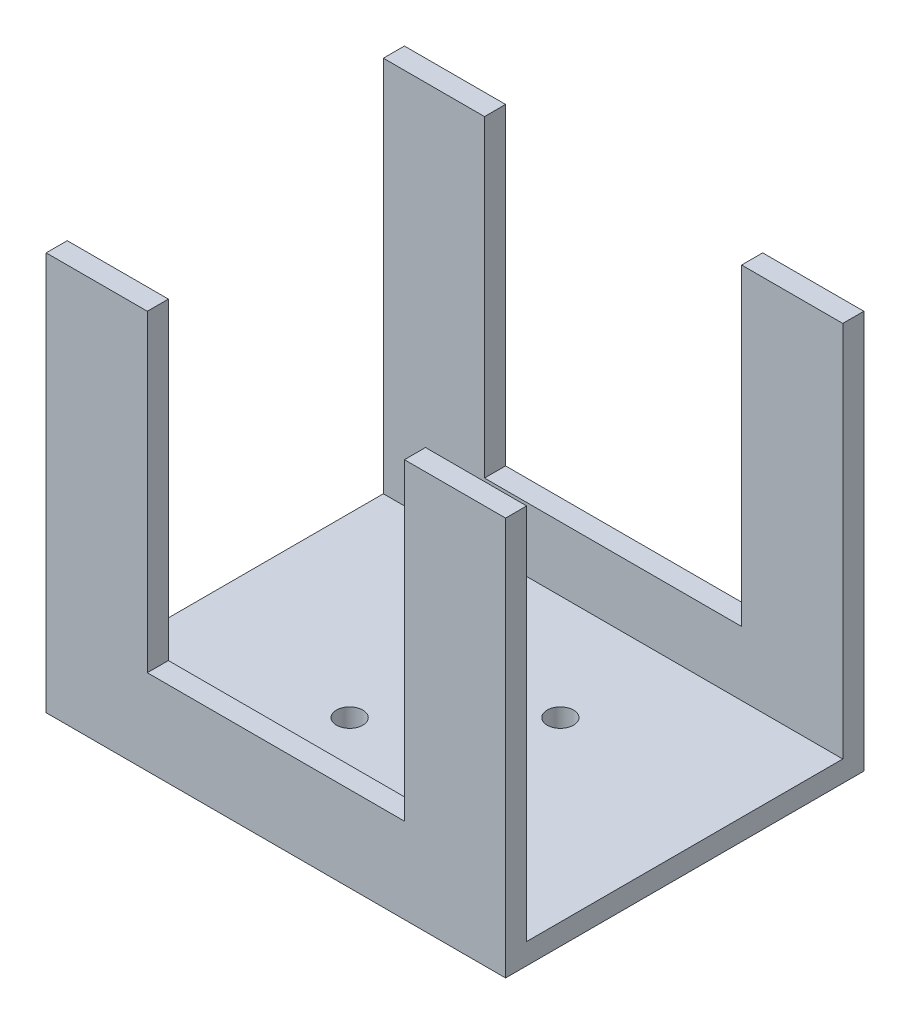
ISO-10303-21;
HEADER;
FILE_DESCRIPTION(('STEP AP214'),'2;1');
FILE_NAME('part.step','',(''),(''),'','','');
FILE_SCHEMA(('AUTOMOTIVE_DESIGN { 1 0 10303 214 1 1 1 1 }'));
ENDSEC;
DATA;
#1=APPLICATION_CONTEXT('core data for automotive mechanical design processes');
#2=APPLICATION_PROTOCOL_DEFINITION('international standard','automotive_design',2000,#1);
#3=PRODUCT_CONTEXT('',#1,'mechanical');
#4=PRODUCT('Part','Part','',(#3));
#5=PRODUCT_RELATED_PRODUCT_CATEGORY('part','',(#4));
#6=PRODUCT_DEFINITION_FORMATION('','',#4);
#7=PRODUCT_DEFINITION_CONTEXT('part definition',#1,'design');
#8=PRODUCT_DEFINITION('design','',#6,#7);
#9=PRODUCT_DEFINITION_SHAPE('','',#8);
#10=(LENGTH_UNIT() NAMED_UNIT(*) SI_UNIT(.MILLI.,.METRE.));
#11=(NAMED_UNIT(*) PLANE_ANGLE_UNIT() SI_UNIT($,.RADIAN.));
#12=(NAMED_UNIT(*) SI_UNIT($,.STERADIAN.) SOLID_ANGLE_UNIT());
#13=UNCERTAINTY_MEASURE_WITH_UNIT(LENGTH_MEASURE(1.E-05),#10,'distance_accuracy_value','');
#14=(GEOMETRIC_REPRESENTATION_CONTEXT(3) GLOBAL_UNCERTAINTY_ASSIGNED_CONTEXT((#13)) GLOBAL_UNIT_ASSIGNED_CONTEXT((#10,
#11,#12)) REPRESENTATION_CONTEXT('',''));
#15=CARTESIAN_POINT('',(0.,0.,0.));
#16=DIRECTION('',(0.,0.,1.));
#17=DIRECTION('',(1.,0.,0.));
#18=AXIS2_PLACEMENT_3D('',#15,#16,#17);
#19=CARTESIAN_POINT('',(-21.8,2.,-17.));
#20=DIRECTION('',(0.,0.,1.));
#21=DIRECTION('',(1.,0.,0.));
#22=AXIS2_PLACEMENT_3D('',#19,#20,#21);
#23=PLANE('',#22);
#24=DIRECTION('',(0.,-1.,0.));
#25=VECTOR('',#24,1.);
#26=CARTESIAN_POINT('',(12.2,2.,-17.));
#27=LINE('',#26,#25);
#28=CARTESIAN_POINT('',(12.2,37.8,-17.));
#29=VERTEX_POINT('',#28);
#30=CARTESIAN_POINT('',(12.2,8.09,-17.));
#31=VERTEX_POINT('',#30);
#32=EDGE_CURVE('E288',#29,#31,#27,.T.);
#33=ORIENTED_EDGE('',*,*,#32,.F.);
#34=DIRECTION('',(-1.,0.,0.));
#35=VECTOR('',#34,1.);
#36=CARTESIAN_POINT('',(-21.8,37.8,-17.));
#37=LINE('',#36,#35);
#38=CARTESIAN_POINT('',(21.8,37.8,-17.));
#39=VERTEX_POINT('',#38);
#40=EDGE_CURVE('E208',#39,#29,#37,.T.);
#41=ORIENTED_EDGE('',*,*,#40,.F.);
#42=DIRECTION('',(0.,-1.,0.));
#43=VECTOR('',#42,1.);
#44=CARTESIAN_POINT('',(21.8,2.,-17.));
#45=LINE('',#44,#43);
#46=CARTESIAN_POINT('',(21.8,0.,-17.));
#47=VERTEX_POINT('',#46);
#48=EDGE_CURVE('E160',#39,#47,#45,.T.);
#49=ORIENTED_EDGE('',*,*,#48,.T.);
#50=DIRECTION('',(-1.,0.,0.));
#51=VECTOR('',#50,1.);
#52=CARTESIAN_POINT('',(-21.8,0.,-17.));
#53=LINE('',#52,#51);
#54=CARTESIAN_POINT('',(-21.8,0.,-17.));
#55=VERTEX_POINT('',#54);
#56=EDGE_CURVE('E228',#47,#55,#53,.T.);
#57=ORIENTED_EDGE('',*,*,#56,.T.);
#58=DIRECTION('',(0.,-1.,0.));
#59=VECTOR('',#58,1.);
#60=CARTESIAN_POINT('',(-21.8,2.,-17.));
#61=LINE('',#60,#59);
#62=CARTESIAN_POINT('',(-21.8,37.8,-17.));
#63=VERTEX_POINT('',#62);
#64=EDGE_CURVE('E237',#63,#55,#61,.T.);
#65=ORIENTED_EDGE('',*,*,#64,.F.);
#66=CARTESIAN_POINT('',(-12.2,37.8,-17.));
#67=VERTEX_POINT('',#66);
#68=EDGE_CURVE('E207',#67,#63,#37,.T.);
#69=ORIENTED_EDGE('',*,*,#68,.F.);
#70=DIRECTION('',(0.,-1.,0.));
#71=VECTOR('',#70,1.);
#72=CARTESIAN_POINT('',(-12.2,2.,-17.));
#73=LINE('',#72,#71);
#74=CARTESIAN_POINT('',(-12.2,8.09,-17.));
#75=VERTEX_POINT('',#74);
#76=EDGE_CURVE('E55',#67,#75,#73,.T.);
#77=ORIENTED_EDGE('',*,*,#76,.T.);
#78=DIRECTION('',(-1.,0.,0.));
#79=VECTOR('',#78,1.);
#80=CARTESIAN_POINT('',(-21.8,8.09,-17.));
#81=LINE('',#80,#79);
#82=EDGE_CURVE('E190',#31,#75,#81,.T.);
#83=ORIENTED_EDGE('',*,*,#82,.F.);
#84=EDGE_LOOP('',(#33,#41,#49,#57,#65,#69,#77,#83));
#85=FACE_BOUND('',#84,.T.);
#86=ADVANCED_FACE('F38',(#85),#23,.F.);
#87=CARTESIAN_POINT('',(-21.8,2.,17.));
#88=DIRECTION('',(0.,0.,-1.));
#89=DIRECTION('',(-1.,0.,0.));
#90=AXIS2_PLACEMENT_3D('',#87,#88,#89);
#91=PLANE('',#90);
#92=DIRECTION('',(0.,-1.,0.));
#93=VECTOR('',#92,1.);
#94=CARTESIAN_POINT('',(12.2,0.,17.));
#95=LINE('',#94,#93);
#96=CARTESIAN_POINT('',(12.2,37.8,17.));
#97=VERTEX_POINT('',#96);
#98=CARTESIAN_POINT('',(12.2,8.09,17.));
#99=VERTEX_POINT('',#98);
#100=EDGE_CURVE('E315',#97,#99,#95,.T.);
#101=ORIENTED_EDGE('',*,*,#100,.T.);
#102=DIRECTION('',(-1.,0.,0.));
#103=VECTOR('',#102,1.);
#104=CARTESIAN_POINT('',(0.,8.09,17.));
#105=LINE('',#104,#103);
#106=CARTESIAN_POINT('',(-12.2,8.09,17.));
#107=VERTEX_POINT('',#106);
#108=EDGE_CURVE('E170',#99,#107,#105,.T.);
#109=ORIENTED_EDGE('',*,*,#108,.T.);
#110=DIRECTION('',(0.,-1.,0.));
#111=VECTOR('',#110,1.);
#112=CARTESIAN_POINT('',(-12.2,0.,17.));
#113=LINE('',#112,#111);
#114=CARTESIAN_POINT('',(-12.2,37.8,17.));
#115=VERTEX_POINT('',#114);
#116=EDGE_CURVE('E155',#115,#107,#113,.T.);
#117=ORIENTED_EDGE('',*,*,#116,.F.);
#118=DIRECTION('',(1.,0.,0.));
#119=VECTOR('',#118,1.);
#120=CARTESIAN_POINT('',(-21.8,37.8,17.));
#121=LINE('',#120,#119);
#122=CARTESIAN_POINT('',(-21.8,37.8,17.));
#123=VERTEX_POINT('',#122);
#124=EDGE_CURVE('E167',#123,#115,#121,.T.);
#125=ORIENTED_EDGE('',*,*,#124,.F.);
#126=DIRECTION('',(0.,-1.,0.));
#127=VECTOR('',#126,1.);
#128=CARTESIAN_POINT('',(-21.8,2.,17.));
#129=LINE('',#128,#127);
#130=CARTESIAN_POINT('',(-21.8,0.,17.));
#131=VERTEX_POINT('',#130);
#132=EDGE_CURVE('E235',#123,#131,#129,.T.);
#133=ORIENTED_EDGE('',*,*,#132,.T.);
#134=DIRECTION('',(1.,0.,0.));
#135=VECTOR('',#134,1.);
#136=CARTESIAN_POINT('',(-21.8,0.,17.));
#137=LINE('',#136,#135);
#138=CARTESIAN_POINT('',(21.8,0.,17.));
#139=VERTEX_POINT('',#138);
#140=EDGE_CURVE('E223',#131,#139,#137,.T.);
#141=ORIENTED_EDGE('',*,*,#140,.T.);
#142=DIRECTION('',(0.,-1.,0.));
#143=VECTOR('',#142,1.);
#144=CARTESIAN_POINT('',(21.8,2.,17.));
#145=LINE('',#144,#143);
#146=CARTESIAN_POINT('',(21.8,37.8,17.));
#147=VERTEX_POINT('',#146);
#148=EDGE_CURVE('E225',#147,#139,#145,.T.);
#149=ORIENTED_EDGE('',*,*,#148,.F.);
#150=EDGE_CURVE('E176',#97,#147,#121,.T.);
#151=ORIENTED_EDGE('',*,*,#150,.F.);
#152=EDGE_LOOP('',(#101,#109,#117,#125,#133,#141,#149,#151));
#153=FACE_BOUND('',#152,.T.);
#154=ADVANCED_FACE('F165',(#153),#91,.F.);
#155=CARTESIAN_POINT('',(-21.8,37.8,-15.));
#156=DIRECTION('',(0.,0.,-1.));
#157=DIRECTION('',(-1.,0.,0.));
#158=AXIS2_PLACEMENT_3D('',#155,#156,#157);
#159=PLANE('',#158);
#160=DIRECTION('',(0.,1.,0.));
#161=VECTOR('',#160,1.);
#162=CARTESIAN_POINT('',(12.2,37.8,-15.));
#163=LINE('',#162,#161);
#164=CARTESIAN_POINT('',(12.2,8.09,-15.));
#165=VERTEX_POINT('',#164);
#166=CARTESIAN_POINT('',(12.2,37.8,-15.));
#167=VERTEX_POINT('',#166);
#168=EDGE_CURVE('E334',#165,#167,#163,.T.);
#169=ORIENTED_EDGE('',*,*,#168,.F.);
#170=DIRECTION('',(1.,0.,0.));
#171=VECTOR('',#170,1.);
#172=CARTESIAN_POINT('',(-21.8,8.09,-15.));
#173=LINE('',#172,#171);
#174=CARTESIAN_POINT('',(-12.2,8.09,-15.));
#175=VERTEX_POINT('',#174);
#176=EDGE_CURVE('E337',#175,#165,#173,.T.);
#177=ORIENTED_EDGE('',*,*,#176,.F.);
#178=DIRECTION('',(0.,1.,0.));
#179=VECTOR('',#178,1.);
#180=CARTESIAN_POINT('',(-12.2,37.8,-15.));
#181=LINE('',#180,#179);
#182=CARTESIAN_POINT('',(-12.2,37.8,-15.));
#183=VERTEX_POINT('',#182);
#184=EDGE_CURVE('E329',#175,#183,#181,.T.);
#185=ORIENTED_EDGE('',*,*,#184,.T.);
#186=DIRECTION('',(1.,0.,0.));
#187=VECTOR('',#186,1.);
#188=CARTESIAN_POINT('',(-21.8,37.8,-15.));
#189=LINE('',#188,#187);
#190=CARTESIAN_POINT('',(-21.8,37.8,-15.));
#191=VERTEX_POINT('',#190);
#192=EDGE_CURVE('E201',#191,#183,#189,.T.);
#193=ORIENTED_EDGE('',*,*,#192,.F.);
#194=DIRECTION('',(0.,-1.,0.));
#195=VECTOR('',#194,1.);
#196=CARTESIAN_POINT('',(-21.8,37.8,-15.));
#197=LINE('',#196,#195);
#198=CARTESIAN_POINT('',(-21.8,2.,-15.));
#199=VERTEX_POINT('',#198);
#200=EDGE_CURVE('E216',#191,#199,#197,.T.);
#201=ORIENTED_EDGE('',*,*,#200,.T.);
#202=DIRECTION('',(1.,0.,0.));
#203=VECTOR('',#202,1.);
#204=CARTESIAN_POINT('',(-21.8,2.,-15.));
#205=LINE('',#204,#203);
#206=CARTESIAN_POINT('',(21.8,2.,-15.));
#207=VERTEX_POINT('',#206);
#208=EDGE_CURVE('E196',#199,#207,#205,.T.);
#209=ORIENTED_EDGE('',*,*,#208,.T.);
#210=DIRECTION('',(0.,-1.,0.));
#211=VECTOR('',#210,1.);
#212=CARTESIAN_POINT('',(21.8,37.8,-15.));
#213=LINE('',#212,#211);
#214=CARTESIAN_POINT('',(21.8,37.8,-15.));
#215=VERTEX_POINT('',#214);
#216=EDGE_CURVE('E211',#215,#207,#213,.T.);
#217=ORIENTED_EDGE('',*,*,#216,.F.);
#218=EDGE_CURVE('E200',#167,#215,#189,.T.);
#219=ORIENTED_EDGE('',*,*,#218,.F.);
#220=EDGE_LOOP('',(#169,#177,#185,#193,#201,#209,#217,#219));
#221=FACE_BOUND('',#220,.T.);
#222=ADVANCED_FACE('F298',(#221),#159,.F.);
#223=CARTESIAN_POINT('',(0.,37.8,0.));
#224=DIRECTION('',(0.,1.,0.));
#225=DIRECTION('',(0.,0.,1.));
#226=AXIS2_PLACEMENT_3D('',#223,#224,#225);
#227=PLANE('',#226);
#228=ORIENTED_EDGE('',*,*,#40,.T.);
#229=DIRECTION('',(0.,0.,1.));
#230=VECTOR('',#229,1.);
#231=CARTESIAN_POINT('',(12.2,37.8,-49.8));
#232=LINE('',#231,#230);
#233=EDGE_CURVE('E292',#29,#167,#232,.T.);
#234=ORIENTED_EDGE('',*,*,#233,.T.);
#235=ORIENTED_EDGE('',*,*,#218,.T.);
#236=DIRECTION('',(0.,0.,-1.));
#237=VECTOR('',#236,1.);
#238=CARTESIAN_POINT('',(21.8,37.8,-17.));
#239=LINE('',#238,#237);
#240=EDGE_CURVE('E204',#215,#39,#239,.T.);
#241=ORIENTED_EDGE('',*,*,#240,.T.);
#242=EDGE_LOOP('',(#228,#234,#235,#241));
#243=FACE_BOUND('',#242,.T.);
#244=ADVANCED_FACE('F291',(#243),#227,.T.);
#245=CARTESIAN_POINT('',(-21.8,37.8,15.));
#246=DIRECTION('',(0.,0.,1.));
#247=DIRECTION('',(1.,0.,0.));
#248=AXIS2_PLACEMENT_3D('',#245,#246,#247);
#249=PLANE('',#248);
#250=DIRECTION('',(0.,-1.,0.));
#251=VECTOR('',#250,1.);
#252=CARTESIAN_POINT('',(12.2,37.8,15.));
#253=LINE('',#252,#251);
#254=CARTESIAN_POINT('',(12.2,37.8,15.));
#255=VERTEX_POINT('',#254);
#256=CARTESIAN_POINT('',(12.2,8.09,15.));
#257=VERTEX_POINT('',#256);
#258=EDGE_CURVE('E308',#255,#257,#253,.T.);
#259=ORIENTED_EDGE('',*,*,#258,.F.);
#260=DIRECTION('',(-1.,0.,0.));
#261=VECTOR('',#260,1.);
#262=CARTESIAN_POINT('',(-21.8,37.8,15.));
#263=LINE('',#262,#261);
#264=CARTESIAN_POINT('',(21.8,37.8,15.));
#265=VERTEX_POINT('',#264);
#266=EDGE_CURVE('E183',#265,#255,#263,.T.);
#267=ORIENTED_EDGE('',*,*,#266,.F.);
#268=DIRECTION('',(0.,-1.,0.));
#269=VECTOR('',#268,1.);
#270=CARTESIAN_POINT('',(21.8,37.8,15.));
#271=LINE('',#270,#269);
#272=CARTESIAN_POINT('',(21.8,2.,15.));
#273=VERTEX_POINT('',#272);
#274=EDGE_CURVE('E193',#265,#273,#271,.T.);
#275=ORIENTED_EDGE('',*,*,#274,.T.);
#276=DIRECTION('',(-1.,0.,0.));
#277=VECTOR('',#276,1.);
#278=CARTESIAN_POINT('',(-21.8,2.,15.));
#279=LINE('',#278,#277);
#280=CARTESIAN_POINT('',(-21.8,2.,15.));
#281=VERTEX_POINT('',#280);
#282=EDGE_CURVE('E187',#273,#281,#279,.T.);
#283=ORIENTED_EDGE('',*,*,#282,.T.);
#284=DIRECTION('',(0.,-1.,0.));
#285=VECTOR('',#284,1.);
#286=CARTESIAN_POINT('',(-21.8,37.8,15.));
#287=LINE('',#286,#285);
#288=CARTESIAN_POINT('',(-21.8,37.8,15.));
#289=VERTEX_POINT('',#288);
#290=EDGE_CURVE('E186',#289,#281,#287,.T.);
#291=ORIENTED_EDGE('',*,*,#290,.F.);
#292=CARTESIAN_POINT('',(-12.2,37.8,15.));
#293=VERTEX_POINT('',#292);
#294=EDGE_CURVE('E178',#293,#289,#263,.T.);
#295=ORIENTED_EDGE('',*,*,#294,.F.);
#296=DIRECTION('',(0.,-1.,0.));
#297=VECTOR('',#296,1.);
#298=CARTESIAN_POINT('',(-12.2,37.8,15.));
#299=LINE('',#298,#297);
#300=CARTESIAN_POINT('',(-12.2,8.09,15.));
#301=VERTEX_POINT('',#300);
#302=EDGE_CURVE('E63',#293,#301,#299,.T.);
#303=ORIENTED_EDGE('',*,*,#302,.T.);
#304=DIRECTION('',(-1.,0.,0.));
#305=VECTOR('',#304,1.);
#306=CARTESIAN_POINT('',(-21.8,8.09,15.));
#307=LINE('',#306,#305);
#308=EDGE_CURVE('E11',#257,#301,#307,.T.);
#309=ORIENTED_EDGE('',*,*,#308,.F.);
#310=EDGE_LOOP('',(#259,#267,#275,#283,#291,#295,#303,#309));
#311=FACE_BOUND('',#310,.T.);
#312=ADVANCED_FACE('F305',(#311),#249,.F.);
#313=CARTESIAN_POINT('',(0.,37.8,0.));
#314=DIRECTION('',(0.,-1.,0.));
#315=DIRECTION('',(0.,0.,-1.));
#316=AXIS2_PLACEMENT_3D('',#313,#314,#315);
#317=PLANE('',#316);
#318=DIRECTION('',(0.,0.,-1.));
#319=VECTOR('',#318,1.);
#320=CARTESIAN_POINT('',(12.2,37.8,0.));
#321=LINE('',#320,#319);
#322=EDGE_CURVE('E47',#97,#255,#321,.T.);
#323=ORIENTED_EDGE('',*,*,#322,.F.);
#324=ORIENTED_EDGE('',*,*,#150,.T.);
#325=DIRECTION('',(0.,0.,-1.));
#326=VECTOR('',#325,1.);
#327=CARTESIAN_POINT('',(21.8,37.8,17.));
#328=LINE('',#327,#326);
#329=EDGE_CURVE('E175',#147,#265,#328,.T.);
#330=ORIENTED_EDGE('',*,*,#329,.T.);
#331=ORIENTED_EDGE('',*,*,#266,.T.);
#332=EDGE_LOOP('',(#323,#324,#330,#331));
#333=FACE_BOUND('',#332,.T.);
#334=ADVANCED_FACE('F311',(#333),#317,.F.);
#335=CARTESIAN_POINT('',(0.,2.,0.));
#336=DIRECTION('',(0.,-1.,0.));
#337=DIRECTION('',(0.,0.,-1.));
#338=AXIS2_PLACEMENT_3D('',#335,#336,#337);
#339=PLANE('',#338);
#340=CARTESIAN_POINT('',(5.00000000000029,2.,4.99999999999972));
#341=DIRECTION('',(0.,1.,0.));
#342=DIRECTION('',(0.,0.,1.));
#343=AXIS2_PLACEMENT_3D('',#340,#341,#342);
#344=CIRCLE('',#343,1.2500000000004);
#345=CARTESIAN_POINT('',(5.00000000000029,2.,6.25000000000012));
#346=VERTEX_POINT('',#345);
#347=EDGE_CURVE('E547',#346,#346,#344,.T.);
#348=ORIENTED_EDGE('',*,*,#347,.F.);
#349=EDGE_LOOP('',(#348));
#350=FACE_BOUND('',#349,.T.);
#351=CARTESIAN_POINT('',(-4.99999999999972,2.,5.));
#352=DIRECTION('',(0.,1.,0.));
#353=DIRECTION('',(0.,0.,1.));
#354=AXIS2_PLACEMENT_3D('',#351,#352,#353);
#355=CIRCLE('',#354,1.25000000000015);
#356=CARTESIAN_POINT('',(-4.99999999999972,2.,6.25000000000015));
#357=VERTEX_POINT('',#356);
#358=EDGE_CURVE('E544',#357,#357,#355,.T.);
#359=ORIENTED_EDGE('',*,*,#358,.F.);
#360=EDGE_LOOP('',(#359));
#361=FACE_BOUND('',#360,.T.);
#362=CARTESIAN_POINT('',(-5.,2.,-5.));
#363=DIRECTION('',(0.,1.,0.));
#364=DIRECTION('',(0.,0.,1.));
#365=AXIS2_PLACEMENT_3D('',#362,#363,#364);
#366=CIRCLE('',#365,1.25);
#367=CARTESIAN_POINT('',(-5.,2.,-3.75));
#368=VERTEX_POINT('',#367);
#369=EDGE_CURVE('E546',#368,#368,#366,.T.);
#370=ORIENTED_EDGE('',*,*,#369,.F.);
#371=EDGE_LOOP('',(#370));
#372=FACE_BOUND('',#371,.T.);
#373=CARTESIAN_POINT('',(5.,2.,-5.00000000000028));
#374=DIRECTION('',(0.,1.,0.));
#375=DIRECTION('',(0.,0.,1.));
#376=AXIS2_PLACEMENT_3D('',#373,#374,#375);
#377=CIRCLE('',#376,1.25000000000029);
#378=CARTESIAN_POINT('',(5.,2.,-3.74999999999999));
#379=VERTEX_POINT('',#378);
#380=EDGE_CURVE('E247',#379,#379,#377,.T.);
#381=ORIENTED_EDGE('',*,*,#380,.F.);
#382=EDGE_LOOP('',(#381));
#383=FACE_BOUND('',#382,.T.);
#384=ORIENTED_EDGE('',*,*,#282,.F.);
#385=DIRECTION('',(0.,0.,-1.));
#386=VECTOR('',#385,1.);
#387=CARTESIAN_POINT('',(21.8,2.,17.));
#388=LINE('',#387,#386);
#389=EDGE_CURVE('E220',#273,#207,#388,.T.);
#390=ORIENTED_EDGE('',*,*,#389,.T.);
#391=ORIENTED_EDGE('',*,*,#208,.F.);
#392=DIRECTION('',(0.,0.,1.));
#393=VECTOR('',#392,1.);
#394=CARTESIAN_POINT('',(-21.8,2.,17.));
#395=LINE('',#394,#393);
#396=EDGE_CURVE('E222',#199,#281,#395,.T.);
#397=ORIENTED_EDGE('',*,*,#396,.T.);
#398=EDGE_LOOP('',(#384,#390,#391,#397));
#399=FACE_BOUND('',#398,.T.);
#400=ADVANCED_FACE('F301',(#350,#361,#372,#383,#399),#339,.F.);
#401=CARTESIAN_POINT('',(21.8,2.,17.));
#402=DIRECTION('',(-1.,0.,0.));
#403=DIRECTION('',(0.,0.,1.));
#404=AXIS2_PLACEMENT_3D('',#401,#402,#403);
#405=PLANE('',#404);
#406=DIRECTION('',(0.,0.,-1.));
#407=VECTOR('',#406,1.);
#408=CARTESIAN_POINT('',(21.8,0.,17.));
#409=LINE('',#408,#407);
#410=EDGE_CURVE('E219',#139,#47,#409,.T.);
#411=ORIENTED_EDGE('',*,*,#410,.T.);
#412=ORIENTED_EDGE('',*,*,#48,.F.);
#413=ORIENTED_EDGE('',*,*,#240,.F.);
#414=ORIENTED_EDGE('',*,*,#216,.T.);
#415=ORIENTED_EDGE('',*,*,#389,.F.);
#416=ORIENTED_EDGE('',*,*,#274,.F.);
#417=ORIENTED_EDGE('',*,*,#329,.F.);
#418=ORIENTED_EDGE('',*,*,#148,.T.);
#419=EDGE_LOOP('',(#411,#412,#413,#414,#415,#416,#417,#418));
#420=FACE_BOUND('',#419,.T.);
#421=ADVANCED_FACE('F40',(#420),#405,.F.);
#422=CARTESIAN_POINT('',(-21.8,2.,17.));
#423=DIRECTION('',(1.,0.,0.));
#424=DIRECTION('',(0.,0.,-1.));
#425=AXIS2_PLACEMENT_3D('',#422,#423,#424);
#426=PLANE('',#425);
#427=DIRECTION('',(0.,0.,1.));
#428=VECTOR('',#427,1.);
#429=CARTESIAN_POINT('',(-21.8,0.,17.));
#430=LINE('',#429,#428);
#431=EDGE_CURVE('E230',#55,#131,#430,.T.);
#432=ORIENTED_EDGE('',*,*,#431,.T.);
#433=ORIENTED_EDGE('',*,*,#132,.F.);
#434=DIRECTION('',(0.,0.,1.));
#435=VECTOR('',#434,1.);
#436=CARTESIAN_POINT('',(-21.8,37.8,17.));
#437=LINE('',#436,#435);
#438=EDGE_CURVE('E174',#289,#123,#437,.T.);
#439=ORIENTED_EDGE('',*,*,#438,.F.);
#440=ORIENTED_EDGE('',*,*,#290,.T.);
#441=ORIENTED_EDGE('',*,*,#396,.F.);
#442=ORIENTED_EDGE('',*,*,#200,.F.);
#443=DIRECTION('',(0.,0.,1.));
#444=VECTOR('',#443,1.);
#445=CARTESIAN_POINT('',(-21.8,37.8,-17.));
#446=LINE('',#445,#444);
#447=EDGE_CURVE('E197',#63,#191,#446,.T.);
#448=ORIENTED_EDGE('',*,*,#447,.F.);
#449=ORIENTED_EDGE('',*,*,#64,.T.);
#450=EDGE_LOOP('',(#432,#433,#439,#440,#441,#442,#448,#449));
#451=FACE_BOUND('',#450,.T.);
#452=ADVANCED_FACE('F263',(#451),#426,.F.);
#453=CARTESIAN_POINT('',(0.,0.,0.));
#454=DIRECTION('',(0.,-1.,0.));
#455=DIRECTION('',(0.,0.,-1.));
#456=AXIS2_PLACEMENT_3D('',#453,#454,#455);
#457=PLANE('',#456);
#458=CARTESIAN_POINT('',(5.00000000000029,0.,4.99999999999972));
#459=DIRECTION('',(0.,-1.,0.));
#460=DIRECTION('',(0.,0.,-1.));
#461=AXIS2_PLACEMENT_3D('',#458,#459,#460);
#462=CIRCLE('',#461,1.2500000000004);
#463=CARTESIAN_POINT('',(5.00000000000029,0.,3.74999999999932));
#464=VERTEX_POINT('',#463);
#465=EDGE_CURVE('E42',#464,#464,#462,.T.);
#466=ORIENTED_EDGE('',*,*,#465,.F.);
#467=EDGE_LOOP('',(#466));
#468=FACE_BOUND('',#467,.T.);
#469=CARTESIAN_POINT('',(-4.99999999999972,0.,5.));
#470=DIRECTION('',(0.,-1.,0.));
#471=DIRECTION('',(0.,0.,-1.));
#472=AXIS2_PLACEMENT_3D('',#469,#470,#471);
#473=CIRCLE('',#472,1.25000000000015);
#474=CARTESIAN_POINT('',(-4.99999999999972,0.,3.74999999999985));
#475=VERTEX_POINT('',#474);
#476=EDGE_CURVE('E249',#475,#475,#473,.T.);
#477=ORIENTED_EDGE('',*,*,#476,.F.);
#478=EDGE_LOOP('',(#477));
#479=FACE_BOUND('',#478,.T.);
#480=CARTESIAN_POINT('',(-5.,0.,-5.));
#481=DIRECTION('',(0.,-1.,0.));
#482=DIRECTION('',(0.,0.,-1.));
#483=AXIS2_PLACEMENT_3D('',#480,#481,#482);
#484=CIRCLE('',#483,1.25);
#485=CARTESIAN_POINT('',(-5.,0.,-6.25));
#486=VERTEX_POINT('',#485);
#487=EDGE_CURVE('E246',#486,#486,#484,.T.);
#488=ORIENTED_EDGE('',*,*,#487,.F.);
#489=EDGE_LOOP('',(#488));
#490=FACE_BOUND('',#489,.T.);
#491=CARTESIAN_POINT('',(5.,0.,-5.00000000000028));
#492=DIRECTION('',(0.,-1.,0.));
#493=DIRECTION('',(0.,0.,-1.));
#494=AXIS2_PLACEMENT_3D('',#491,#492,#493);
#495=CIRCLE('',#494,1.25000000000029);
#496=CARTESIAN_POINT('',(5.,0.,-6.25000000000057));
#497=VERTEX_POINT('',#496);
#498=EDGE_CURVE('E243',#497,#497,#495,.T.);
#499=ORIENTED_EDGE('',*,*,#498,.F.);
#500=EDGE_LOOP('',(#499));
#501=FACE_BOUND('',#500,.T.);
#502=ORIENTED_EDGE('',*,*,#410,.F.);
#503=ORIENTED_EDGE('',*,*,#140,.F.);
#504=ORIENTED_EDGE('',*,*,#431,.F.);
#505=ORIENTED_EDGE('',*,*,#56,.F.);
#506=EDGE_LOOP('',(#502,#503,#504,#505));
#507=FACE_BOUND('',#506,.T.);
#508=ADVANCED_FACE('F259',(#468,#479,#490,#501,#507),#457,.T.);
#509=DIRECTION('',(0.,0.,1.));
#510=VECTOR('',#509,1.);
#511=CARTESIAN_POINT('',(-12.2,37.8,-49.8));
#512=LINE('',#511,#510);
#513=EDGE_CURVE('E317',#67,#183,#512,.T.);
#514=ORIENTED_EDGE('',*,*,#513,.F.);
#515=ORIENTED_EDGE('',*,*,#68,.T.);
#516=ORIENTED_EDGE('',*,*,#447,.T.);
#517=ORIENTED_EDGE('',*,*,#192,.T.);
#518=EDGE_LOOP('',(#514,#515,#516,#517));
#519=FACE_BOUND('',#518,.T.);
#520=ADVANCED_FACE('F262',(#519),#227,.T.);
#521=ORIENTED_EDGE('',*,*,#124,.T.);
#522=DIRECTION('',(0.,0.,-1.));
#523=VECTOR('',#522,1.);
#524=CARTESIAN_POINT('',(-12.2,37.8,0.));
#525=LINE('',#524,#523);
#526=EDGE_CURVE('E152',#115,#293,#525,.T.);
#527=ORIENTED_EDGE('',*,*,#526,.T.);
#528=ORIENTED_EDGE('',*,*,#294,.T.);
#529=ORIENTED_EDGE('',*,*,#438,.T.);
#530=EDGE_LOOP('',(#521,#527,#528,#529));
#531=FACE_BOUND('',#530,.T.);
#532=ADVANCED_FACE('F172',(#531),#317,.F.);
#533=CARTESIAN_POINT('',(-12.2,0.,-49.8));
#534=DIRECTION('',(-1.,0.,0.));
#535=DIRECTION('',(0.,-1.,0.));
#536=AXIS2_PLACEMENT_3D('',#533,#534,#535);
#537=PLANE('',#536);
#538=ORIENTED_EDGE('',*,*,#526,.F.);
#539=ORIENTED_EDGE('',*,*,#116,.T.);
#540=DIRECTION('',(0.,0.,1.));
#541=VECTOR('',#540,1.);
#542=CARTESIAN_POINT('',(-12.2,8.09,-49.8));
#543=LINE('',#542,#541);
#544=EDGE_CURVE('E319',#301,#107,#543,.T.);
#545=ORIENTED_EDGE('',*,*,#544,.F.);
#546=ORIENTED_EDGE('',*,*,#302,.F.);
#547=EDGE_LOOP('',(#538,#539,#545,#546));
#548=FACE_BOUND('',#547,.T.);
#549=ADVANCED_FACE('F154',(#548),#537,.F.);
#550=CARTESIAN_POINT('',(12.2,0.,-49.8));
#551=DIRECTION('',(-1.,0.,0.));
#552=DIRECTION('',(0.,-1.,0.));
#553=AXIS2_PLACEMENT_3D('',#550,#551,#552);
#554=PLANE('',#553);
#555=ORIENTED_EDGE('',*,*,#258,.T.);
#556=DIRECTION('',(0.,0.,1.));
#557=VECTOR('',#556,1.);
#558=CARTESIAN_POINT('',(12.2,8.09,-49.8));
#559=LINE('',#558,#557);
#560=EDGE_CURVE('E316',#257,#99,#559,.T.);
#561=ORIENTED_EDGE('',*,*,#560,.T.);
#562=ORIENTED_EDGE('',*,*,#100,.F.);
#563=ORIENTED_EDGE('',*,*,#322,.T.);
#564=EDGE_LOOP('',(#555,#561,#562,#563));
#565=FACE_BOUND('',#564,.T.);
#566=ADVANCED_FACE('F313',(#565),#554,.T.);
#567=CARTESIAN_POINT('',(0.,8.09,-49.8));
#568=DIRECTION('',(0.,1.,0.));
#569=DIRECTION('',(0.,0.,1.));
#570=AXIS2_PLACEMENT_3D('',#567,#568,#569);
#571=PLANE('',#570);
#572=ORIENTED_EDGE('',*,*,#308,.T.);
#573=ORIENTED_EDGE('',*,*,#544,.T.);
#574=ORIENTED_EDGE('',*,*,#108,.F.);
#575=ORIENTED_EDGE('',*,*,#560,.F.);
#576=EDGE_LOOP('',(#572,#573,#574,#575));
#577=FACE_BOUND('',#576,.T.);
#578=ADVANCED_FACE('F453',(#577),#571,.T.);
#579=ORIENTED_EDGE('',*,*,#82,.T.);
#580=EDGE_CURVE('E326',#75,#175,#543,.T.);
#581=ORIENTED_EDGE('',*,*,#580,.T.);
#582=ORIENTED_EDGE('',*,*,#176,.T.);
#583=EDGE_CURVE('E324',#31,#165,#559,.T.);
#584=ORIENTED_EDGE('',*,*,#583,.F.);
#585=EDGE_LOOP('',(#579,#581,#582,#584));
#586=FACE_BOUND('',#585,.T.);
#587=ADVANCED_FACE('F341',(#586),#571,.T.);
#588=ORIENTED_EDGE('',*,*,#32,.T.);
#589=ORIENTED_EDGE('',*,*,#583,.T.);
#590=ORIENTED_EDGE('',*,*,#168,.T.);
#591=ORIENTED_EDGE('',*,*,#233,.F.);
#592=EDGE_LOOP('',(#588,#589,#590,#591));
#593=FACE_BOUND('',#592,.T.);
#594=ADVANCED_FACE('F447',(#593),#554,.T.);
#595=ORIENTED_EDGE('',*,*,#513,.T.);
#596=ORIENTED_EDGE('',*,*,#184,.F.);
#597=ORIENTED_EDGE('',*,*,#580,.F.);
#598=ORIENTED_EDGE('',*,*,#76,.F.);
#599=EDGE_LOOP('',(#595,#596,#597,#598));
#600=FACE_BOUND('',#599,.T.);
#601=ADVANCED_FACE('F344',(#600),#537,.F.);
#602=CARTESIAN_POINT('',(5.,-64.8,-5.00000000000028));
#603=DIRECTION('',(0.,1.,0.));
#604=DIRECTION('',(0.,0.,1.));
#605=AXIS2_PLACEMENT_3D('',#602,#603,#604);
#606=CYLINDRICAL_SURFACE('',#605,1.25000000000029);
#607=ORIENTED_EDGE('',*,*,#498,.T.);
#608=EDGE_LOOP('',(#607));
#609=FACE_BOUND('',#608,.T.);
#610=ORIENTED_EDGE('',*,*,#380,.T.);
#611=EDGE_LOOP('',(#610));
#612=FACE_BOUND('',#611,.T.);
#613=ADVANCED_FACE('F408',(#609,#612),#606,.F.);
#614=CARTESIAN_POINT('',(-5.,-64.8,-5.));
#615=DIRECTION('',(0.,1.,0.));
#616=DIRECTION('',(0.,0.,1.));
#617=AXIS2_PLACEMENT_3D('',#614,#615,#616);
#618=CYLINDRICAL_SURFACE('',#617,1.25);
#619=ORIENTED_EDGE('',*,*,#487,.T.);
#620=EDGE_LOOP('',(#619));
#621=FACE_BOUND('',#620,.T.);
#622=ORIENTED_EDGE('',*,*,#369,.T.);
#623=EDGE_LOOP('',(#622));
#624=FACE_BOUND('',#623,.T.);
#625=ADVANCED_FACE('F413',(#621,#624),#618,.F.);
#626=CARTESIAN_POINT('',(-4.99999999999972,-64.8,5.));
#627=DIRECTION('',(0.,1.,0.));
#628=DIRECTION('',(0.,0.,1.));
#629=AXIS2_PLACEMENT_3D('',#626,#627,#628);
#630=CYLINDRICAL_SURFACE('',#629,1.25000000000015);
#631=ORIENTED_EDGE('',*,*,#476,.T.);
#632=EDGE_LOOP('',(#631));
#633=FACE_BOUND('',#632,.T.);
#634=ORIENTED_EDGE('',*,*,#358,.T.);
#635=EDGE_LOOP('',(#634));
#636=FACE_BOUND('',#635,.T.);
#637=ADVANCED_FACE('F425',(#633,#636),#630,.F.);
#638=CARTESIAN_POINT('',(5.00000000000029,-64.8,4.99999999999972));
#639=DIRECTION('',(0.,1.,0.));
#640=DIRECTION('',(0.,0.,1.));
#641=AXIS2_PLACEMENT_3D('',#638,#639,#640);
#642=CYLINDRICAL_SURFACE('',#641,1.2500000000004);
#643=ORIENTED_EDGE('',*,*,#465,.T.);
#644=EDGE_LOOP('',(#643));
#645=FACE_BOUND('',#644,.T.);
#646=ORIENTED_EDGE('',*,*,#347,.T.);
#647=EDGE_LOOP('',(#646));
#648=FACE_BOUND('',#647,.T.);
#649=ADVANCED_FACE('F256',(#645,#648),#642,.F.);
#650=CLOSED_SHELL('',(#86,#154,#222,#244,#312,#334,#400,#421,#452,#508,#520,#532,#549,#566,#578,
#587,#594,#601,#613,#625,#637,#649));
#651=MANIFOLD_SOLID_BREP('B2',#650);
#652=ADVANCED_BREP_SHAPE_REPRESENTATION('',(#18,#651),#14);
#653=SHAPE_DEFINITION_REPRESENTATION(#9,#652);
ENDSEC;
END-ISO-10303-21;
